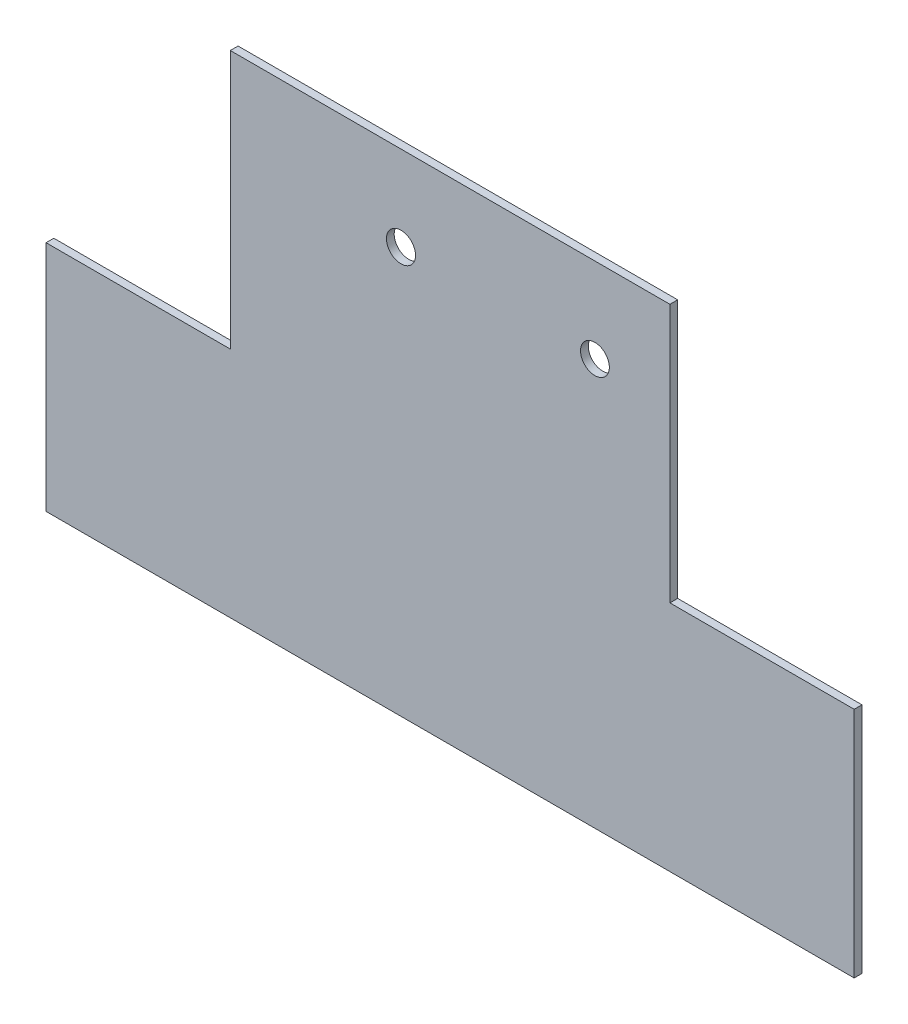
ISO-10303-21;
HEADER;
FILE_DESCRIPTION(('STEP AP214'),'2;1');
FILE_NAME('part.step','',(''),(''),'','','');
FILE_SCHEMA(('AUTOMOTIVE_DESIGN { 1 0 10303 214 1 1 1 1 }'));
ENDSEC;
DATA;
#1=APPLICATION_CONTEXT('core data for automotive mechanical design processes');
#2=APPLICATION_PROTOCOL_DEFINITION('international standard','automotive_design',2000,#1);
#3=PRODUCT_CONTEXT('',#1,'mechanical');
#4=PRODUCT('Part','Part','',(#3));
#5=PRODUCT_RELATED_PRODUCT_CATEGORY('part','',(#4));
#6=PRODUCT_DEFINITION_FORMATION('','',#4);
#7=PRODUCT_DEFINITION_CONTEXT('part definition',#1,'design');
#8=PRODUCT_DEFINITION('design','',#6,#7);
#9=PRODUCT_DEFINITION_SHAPE('','',#8);
#10=(LENGTH_UNIT() NAMED_UNIT(*) SI_UNIT(.MILLI.,.METRE.));
#11=(NAMED_UNIT(*) PLANE_ANGLE_UNIT() SI_UNIT($,.RADIAN.));
#12=(NAMED_UNIT(*) SI_UNIT($,.STERADIAN.) SOLID_ANGLE_UNIT());
#13=UNCERTAINTY_MEASURE_WITH_UNIT(LENGTH_MEASURE(1.E-05),#10,'distance_accuracy_value','');
#14=(GEOMETRIC_REPRESENTATION_CONTEXT(3) GLOBAL_UNCERTAINTY_ASSIGNED_CONTEXT((#13)) GLOBAL_UNIT_ASSIGNED_CONTEXT((#10,
#11,#12)) REPRESENTATION_CONTEXT('',''));
#15=CARTESIAN_POINT('',(0.,0.,0.));
#16=DIRECTION('',(0.,0.,1.));
#17=DIRECTION('',(1.,0.,0.));
#18=AXIS2_PLACEMENT_3D('',#15,#16,#17);
#19=CARTESIAN_POINT('',(0.,0.,-1.2));
#20=DIRECTION('',(-1.,0.,0.));
#21=DIRECTION('',(0.,0.,1.));
#22=AXIS2_PLACEMENT_3D('',#19,#20,#21);
#23=PLANE('',#22);
#24=DIRECTION('',(0.,-1.,0.));
#25=VECTOR('',#24,1.);
#26=CARTESIAN_POINT('',(0.,0.,0.));
#27=LINE('',#26,#25);
#28=CARTESIAN_POINT('',(0.,36.,0.));
#29=VERTEX_POINT('',#28);
#30=CARTESIAN_POINT('',(0.,0.,0.));
#31=VERTEX_POINT('',#30);
#32=EDGE_CURVE('E136',#29,#31,#27,.T.);
#33=ORIENTED_EDGE('',*,*,#32,.F.);
#34=DIRECTION('',(0.,0.,1.));
#35=VECTOR('',#34,1.);
#36=CARTESIAN_POINT('',(0.,36.,-1.2));
#37=LINE('',#36,#35);
#38=CARTESIAN_POINT('',(0.,36.,-1.2));
#39=VERTEX_POINT('',#38);
#40=EDGE_CURVE('E11',#39,#29,#37,.T.);
#41=ORIENTED_EDGE('',*,*,#40,.F.);
#42=DIRECTION('',(0.,-1.,0.));
#43=VECTOR('',#42,1.);
#44=CARTESIAN_POINT('',(0.,0.,-1.2));
#45=LINE('',#44,#43);
#46=CARTESIAN_POINT('',(0.,0.,-1.2));
#47=VERTEX_POINT('',#46);
#48=EDGE_CURVE('E157',#39,#47,#45,.T.);
#49=ORIENTED_EDGE('',*,*,#48,.T.);
#50=DIRECTION('',(0.,0.,1.));
#51=VECTOR('',#50,1.);
#52=CARTESIAN_POINT('',(0.,0.,-1.2));
#53=LINE('',#52,#51);
#54=EDGE_CURVE('E42',#47,#31,#53,.T.);
#55=ORIENTED_EDGE('',*,*,#54,.T.);
#56=EDGE_LOOP('',(#33,#41,#49,#55));
#57=FACE_BOUND('',#56,.T.);
#58=ADVANCED_FACE('F39',(#57),#23,.T.);
#59=CARTESIAN_POINT('',(0.,36.,-1.2));
#60=DIRECTION('',(0.,1.,0.));
#61=DIRECTION('',(0.,0.,1.));
#62=AXIS2_PLACEMENT_3D('',#59,#60,#61);
#63=PLANE('',#62);
#64=DIRECTION('',(-1.,0.,0.));
#65=VECTOR('',#64,1.);
#66=CARTESIAN_POINT('',(0.,36.,0.));
#67=LINE('',#66,#65);
#68=CARTESIAN_POINT('',(28.5,36.,0.));
#69=VERTEX_POINT('',#68);
#70=EDGE_CURVE('E155',#69,#29,#67,.T.);
#71=ORIENTED_EDGE('',*,*,#70,.F.);
#72=DIRECTION('',(0.,0.,1.));
#73=VECTOR('',#72,1.);
#74=CARTESIAN_POINT('',(28.5,36.,-1.2));
#75=LINE('',#74,#73);
#76=CARTESIAN_POINT('',(28.5,36.,-1.2));
#77=VERTEX_POINT('',#76);
#78=EDGE_CURVE('E48',#77,#69,#75,.T.);
#79=ORIENTED_EDGE('',*,*,#78,.F.);
#80=DIRECTION('',(-1.,0.,0.));
#81=VECTOR('',#80,1.);
#82=CARTESIAN_POINT('',(0.,36.,-1.2));
#83=LINE('',#82,#81);
#84=EDGE_CURVE('E126',#77,#39,#83,.T.);
#85=ORIENTED_EDGE('',*,*,#84,.T.);
#86=ORIENTED_EDGE('',*,*,#40,.T.);
#87=EDGE_LOOP('',(#71,#79,#85,#86));
#88=FACE_BOUND('',#87,.T.);
#89=ADVANCED_FACE('F169',(#88),#63,.T.);
#90=CARTESIAN_POINT('',(28.5,36.,-1.2));
#91=DIRECTION('',(-1.,0.,0.));
#92=DIRECTION('',(0.,0.,1.));
#93=AXIS2_PLACEMENT_3D('',#90,#91,#92);
#94=PLANE('',#93);
#95=DIRECTION('',(0.,-1.,0.));
#96=VECTOR('',#95,1.);
#97=CARTESIAN_POINT('',(28.5,36.,0.));
#98=LINE('',#97,#96);
#99=CARTESIAN_POINT('',(28.5,76.,0.));
#100=VERTEX_POINT('',#99);
#101=EDGE_CURVE('E113',#100,#69,#98,.T.);
#102=ORIENTED_EDGE('',*,*,#101,.F.);
#103=DIRECTION('',(0.,0.,1.));
#104=VECTOR('',#103,1.);
#105=CARTESIAN_POINT('',(28.5,76.,-1.2));
#106=LINE('',#105,#104);
#107=CARTESIAN_POINT('',(28.5,76.,-1.2));
#108=VERTEX_POINT('',#107);
#109=EDGE_CURVE('E108',#108,#100,#106,.T.);
#110=ORIENTED_EDGE('',*,*,#109,.F.);
#111=DIRECTION('',(0.,-1.,0.));
#112=VECTOR('',#111,1.);
#113=CARTESIAN_POINT('',(28.5,36.,-1.2));
#114=LINE('',#113,#112);
#115=EDGE_CURVE('E111',#108,#77,#114,.T.);
#116=ORIENTED_EDGE('',*,*,#115,.T.);
#117=ORIENTED_EDGE('',*,*,#78,.T.);
#118=EDGE_LOOP('',(#102,#110,#116,#117));
#119=FACE_BOUND('',#118,.T.);
#120=ADVANCED_FACE('F110',(#119),#94,.T.);
#121=CARTESIAN_POINT('',(28.5,76.,-1.2));
#122=DIRECTION('',(0.,1.,0.));
#123=DIRECTION('',(0.,0.,1.));
#124=AXIS2_PLACEMENT_3D('',#121,#122,#123);
#125=PLANE('',#124);
#126=DIRECTION('',(-1.,0.,0.));
#127=VECTOR('',#126,1.);
#128=CARTESIAN_POINT('',(28.5,76.,0.));
#129=LINE('',#128,#127);
#130=CARTESIAN_POINT('',(96.5,76.,0.));
#131=VERTEX_POINT('',#130);
#132=EDGE_CURVE('E152',#131,#100,#129,.T.);
#133=ORIENTED_EDGE('',*,*,#132,.F.);
#134=DIRECTION('',(0.,0.,1.));
#135=VECTOR('',#134,1.);
#136=CARTESIAN_POINT('',(96.5,76.,-1.2));
#137=LINE('',#136,#135);
#138=CARTESIAN_POINT('',(96.5,76.,-1.2));
#139=VERTEX_POINT('',#138);
#140=EDGE_CURVE('E118',#139,#131,#137,.T.);
#141=ORIENTED_EDGE('',*,*,#140,.F.);
#142=DIRECTION('',(-1.,0.,0.));
#143=VECTOR('',#142,1.);
#144=CARTESIAN_POINT('',(28.5,76.,-1.2));
#145=LINE('',#144,#143);
#146=EDGE_CURVE('E124',#139,#108,#145,.T.);
#147=ORIENTED_EDGE('',*,*,#146,.T.);
#148=ORIENTED_EDGE('',*,*,#109,.T.);
#149=EDGE_LOOP('',(#133,#141,#147,#148));
#150=FACE_BOUND('',#149,.T.);
#151=ADVANCED_FACE('F128',(#150),#125,.T.);
#152=CARTESIAN_POINT('',(96.5,76.,-1.2));
#153=DIRECTION('',(1.,0.,0.));
#154=DIRECTION('',(0.,0.,-1.));
#155=AXIS2_PLACEMENT_3D('',#152,#153,#154);
#156=PLANE('',#155);
#157=DIRECTION('',(0.,1.,0.));
#158=VECTOR('',#157,1.);
#159=CARTESIAN_POINT('',(96.5,76.,0.));
#160=LINE('',#159,#158);
#161=CARTESIAN_POINT('',(96.5,36.,0.));
#162=VERTEX_POINT('',#161);
#163=EDGE_CURVE('E149',#162,#131,#160,.T.);
#164=ORIENTED_EDGE('',*,*,#163,.F.);
#165=DIRECTION('',(0.,0.,1.));
#166=VECTOR('',#165,1.);
#167=CARTESIAN_POINT('',(96.5,36.,-1.2));
#168=LINE('',#167,#166);
#169=CARTESIAN_POINT('',(96.5,36.,-1.2));
#170=VERTEX_POINT('',#169);
#171=EDGE_CURVE('E161',#170,#162,#168,.T.);
#172=ORIENTED_EDGE('',*,*,#171,.F.);
#173=DIRECTION('',(0.,1.,0.));
#174=VECTOR('',#173,1.);
#175=CARTESIAN_POINT('',(96.5,76.,-1.2));
#176=LINE('',#175,#174);
#177=EDGE_CURVE('E129',#170,#139,#176,.T.);
#178=ORIENTED_EDGE('',*,*,#177,.T.);
#179=ORIENTED_EDGE('',*,*,#140,.T.);
#180=EDGE_LOOP('',(#164,#172,#178,#179));
#181=FACE_BOUND('',#180,.T.);
#182=ADVANCED_FACE('F182',(#181),#156,.T.);
#183=CARTESIAN_POINT('',(96.5,36.,-1.2));
#184=DIRECTION('',(0.,1.,0.));
#185=DIRECTION('',(-1.,0.,0.));
#186=AXIS2_PLACEMENT_3D('',#183,#184,#185);
#187=PLANE('',#186);
#188=DIRECTION('',(-1.,0.,0.));
#189=VECTOR('',#188,1.);
#190=CARTESIAN_POINT('',(96.5,36.,0.));
#191=LINE('',#190,#189);
#192=CARTESIAN_POINT('',(125.,36.,0.));
#193=VERTEX_POINT('',#192);
#194=EDGE_CURVE('E146',#193,#162,#191,.T.);
#195=ORIENTED_EDGE('',*,*,#194,.F.);
#196=DIRECTION('',(0.,0.,1.));
#197=VECTOR('',#196,1.);
#198=CARTESIAN_POINT('',(125.,36.,-1.2));
#199=LINE('',#198,#197);
#200=CARTESIAN_POINT('',(125.,36.,-1.2));
#201=VERTEX_POINT('',#200);
#202=EDGE_CURVE('E163',#201,#193,#199,.T.);
#203=ORIENTED_EDGE('',*,*,#202,.F.);
#204=DIRECTION('',(-1.,0.,0.));
#205=VECTOR('',#204,1.);
#206=CARTESIAN_POINT('',(96.5,36.,-1.2));
#207=LINE('',#206,#205);
#208=EDGE_CURVE('E131',#201,#170,#207,.T.);
#209=ORIENTED_EDGE('',*,*,#208,.T.);
#210=ORIENTED_EDGE('',*,*,#171,.T.);
#211=EDGE_LOOP('',(#195,#203,#209,#210));
#212=FACE_BOUND('',#211,.T.);
#213=ADVANCED_FACE('F185',(#212),#187,.T.);
#214=CARTESIAN_POINT('',(125.,0.,-1.2));
#215=DIRECTION('',(1.,0.,0.));
#216=DIRECTION('',(0.,0.,-1.));
#217=AXIS2_PLACEMENT_3D('',#214,#215,#216);
#218=PLANE('',#217);
#219=DIRECTION('',(0.,1.,0.));
#220=VECTOR('',#219,1.);
#221=CARTESIAN_POINT('',(125.,0.,0.));
#222=LINE('',#221,#220);
#223=CARTESIAN_POINT('',(125.,0.,0.));
#224=VERTEX_POINT('',#223);
#225=EDGE_CURVE('E143',#224,#193,#222,.T.);
#226=ORIENTED_EDGE('',*,*,#225,.F.);
#227=DIRECTION('',(0.,0.,1.));
#228=VECTOR('',#227,1.);
#229=CARTESIAN_POINT('',(125.,0.,-1.2));
#230=LINE('',#229,#228);
#231=CARTESIAN_POINT('',(125.,0.,-1.2));
#232=VERTEX_POINT('',#231);
#233=EDGE_CURVE('E164',#232,#224,#230,.T.);
#234=ORIENTED_EDGE('',*,*,#233,.F.);
#235=DIRECTION('',(0.,1.,0.));
#236=VECTOR('',#235,1.);
#237=CARTESIAN_POINT('',(125.,0.,-1.2));
#238=LINE('',#237,#236);
#239=EDGE_CURVE('E231',#232,#201,#238,.T.);
#240=ORIENTED_EDGE('',*,*,#239,.T.);
#241=ORIENTED_EDGE('',*,*,#202,.T.);
#242=EDGE_LOOP('',(#226,#234,#240,#241));
#243=FACE_BOUND('',#242,.T.);
#244=ADVANCED_FACE('F189',(#243),#218,.T.);
#245=CARTESIAN_POINT('',(0.,0.,-1.2));
#246=DIRECTION('',(0.,-1.,0.));
#247=DIRECTION('',(0.,0.,-1.));
#248=AXIS2_PLACEMENT_3D('',#245,#246,#247);
#249=PLANE('',#248);
#250=DIRECTION('',(1.,0.,0.));
#251=VECTOR('',#250,1.);
#252=CARTESIAN_POINT('',(0.,0.,0.));
#253=LINE('',#252,#251);
#254=EDGE_CURVE('E139',#31,#224,#253,.T.);
#255=ORIENTED_EDGE('',*,*,#254,.F.);
#256=ORIENTED_EDGE('',*,*,#54,.F.);
#257=DIRECTION('',(1.,0.,0.));
#258=VECTOR('',#257,1.);
#259=CARTESIAN_POINT('',(0.,0.,-1.2));
#260=LINE('',#259,#258);
#261=EDGE_CURVE('E229',#47,#232,#260,.T.);
#262=ORIENTED_EDGE('',*,*,#261,.T.);
#263=ORIENTED_EDGE('',*,*,#233,.T.);
#264=EDGE_LOOP('',(#255,#256,#262,#263));
#265=FACE_BOUND('',#264,.T.);
#266=ADVANCED_FACE('F166',(#265),#249,.T.);
#267=CARTESIAN_POINT('',(0.,0.,-1.2));
#268=DIRECTION('',(0.,0.,-1.));
#269=DIRECTION('',(-1.,0.,0.));
#270=AXIS2_PLACEMENT_3D('',#267,#268,#269);
#271=PLANE('',#270);
#272=CARTESIAN_POINT('',(84.8999999999992,62.8699999999998,-1.2));
#273=DIRECTION('',(0.,0.,1.));
#274=DIRECTION('',(1.,0.,0.));
#275=AXIS2_PLACEMENT_3D('',#272,#273,#274);
#276=CIRCLE('',#275,2.22734847298146);
#277=CARTESIAN_POINT('',(87.1273484729807,62.8699999999998,-1.2));
#278=VERTEX_POINT('',#277);
#279=EDGE_CURVE('E216',#278,#278,#276,.T.);
#280=ORIENTED_EDGE('',*,*,#279,.T.);
#281=EDGE_LOOP('',(#280));
#282=FACE_BOUND('',#281,.T.);
#283=CARTESIAN_POINT('',(54.8999999999992,62.8699999999998,-1.2));
#284=DIRECTION('',(0.,0.,1.));
#285=DIRECTION('',(1.,0.,0.));
#286=AXIS2_PLACEMENT_3D('',#283,#284,#285);
#287=CIRCLE('',#286,2.25);
#288=CARTESIAN_POINT('',(57.1499999999992,62.8699999999998,-1.2));
#289=VERTEX_POINT('',#288);
#290=EDGE_CURVE('E140',#289,#289,#287,.T.);
#291=ORIENTED_EDGE('',*,*,#290,.T.);
#292=EDGE_LOOP('',(#291));
#293=FACE_BOUND('',#292,.T.);
#294=ORIENTED_EDGE('',*,*,#48,.F.);
#295=ORIENTED_EDGE('',*,*,#84,.F.);
#296=ORIENTED_EDGE('',*,*,#115,.F.);
#297=ORIENTED_EDGE('',*,*,#146,.F.);
#298=ORIENTED_EDGE('',*,*,#177,.F.);
#299=ORIENTED_EDGE('',*,*,#208,.F.);
#300=ORIENTED_EDGE('',*,*,#239,.F.);
#301=ORIENTED_EDGE('',*,*,#261,.F.);
#302=EDGE_LOOP('',(#294,#295,#296,#297,#298,#299,#300,#301));
#303=FACE_BOUND('',#302,.T.);
#304=ADVANCED_FACE('F122',(#282,#293,#303),#271,.T.);
#305=CARTESIAN_POINT('',(0.,0.,0.));
#306=DIRECTION('',(0.,0.,-1.));
#307=DIRECTION('',(-1.,0.,0.));
#308=AXIS2_PLACEMENT_3D('',#305,#306,#307);
#309=PLANE('',#308);
#310=CARTESIAN_POINT('',(84.8999999999992,62.8699999999998,0.));
#311=DIRECTION('',(0.,0.,1.));
#312=DIRECTION('',(1.,0.,0.));
#313=AXIS2_PLACEMENT_3D('',#310,#311,#312);
#314=CIRCLE('',#313,2.22734847298146);
#315=CARTESIAN_POINT('',(87.1273484729807,62.8699999999998,0.));
#316=VERTEX_POINT('',#315);
#317=EDGE_CURVE('E219',#316,#316,#314,.T.);
#318=ORIENTED_EDGE('',*,*,#317,.F.);
#319=EDGE_LOOP('',(#318));
#320=FACE_BOUND('',#319,.T.);
#321=CARTESIAN_POINT('',(54.8999999999992,62.8699999999998,0.));
#322=DIRECTION('',(0.,0.,1.));
#323=DIRECTION('',(1.,0.,0.));
#324=AXIS2_PLACEMENT_3D('',#321,#322,#323);
#325=CIRCLE('',#324,2.25);
#326=CARTESIAN_POINT('',(57.1499999999992,62.8699999999998,0.));
#327=VERTEX_POINT('',#326);
#328=EDGE_CURVE('E221',#327,#327,#325,.T.);
#329=ORIENTED_EDGE('',*,*,#328,.F.);
#330=EDGE_LOOP('',(#329));
#331=FACE_BOUND('',#330,.T.);
#332=ORIENTED_EDGE('',*,*,#32,.T.);
#333=ORIENTED_EDGE('',*,*,#254,.T.);
#334=ORIENTED_EDGE('',*,*,#225,.T.);
#335=ORIENTED_EDGE('',*,*,#194,.T.);
#336=ORIENTED_EDGE('',*,*,#163,.T.);
#337=ORIENTED_EDGE('',*,*,#132,.T.);
#338=ORIENTED_EDGE('',*,*,#101,.T.);
#339=ORIENTED_EDGE('',*,*,#70,.T.);
#340=EDGE_LOOP('',(#332,#333,#334,#335,#336,#337,#338,#339));
#341=FACE_BOUND('',#340,.T.);
#342=ADVANCED_FACE('F168',(#320,#331,#341),#309,.F.);
#343=CARTESIAN_POINT('',(54.8999999999992,62.8699999999998,-1.2));
#344=DIRECTION('',(0.,0.,1.));
#345=DIRECTION('',(1.,0.,0.));
#346=AXIS2_PLACEMENT_3D('',#343,#344,#345);
#347=CYLINDRICAL_SURFACE('',#346,2.25);
#348=ORIENTED_EDGE('',*,*,#290,.F.);
#349=EDGE_LOOP('',(#348));
#350=FACE_BOUND('',#349,.T.);
#351=ORIENTED_EDGE('',*,*,#328,.T.);
#352=EDGE_LOOP('',(#351));
#353=FACE_BOUND('',#352,.T.);
#354=ADVANCED_FACE('F201',(#350,#353),#347,.F.);
#355=CARTESIAN_POINT('',(84.8999999999992,62.8699999999998,-1.2));
#356=DIRECTION('',(0.,0.,1.));
#357=DIRECTION('',(1.,0.,0.));
#358=AXIS2_PLACEMENT_3D('',#355,#356,#357);
#359=CYLINDRICAL_SURFACE('',#358,2.22734847298146);
#360=ORIENTED_EDGE('',*,*,#279,.F.);
#361=EDGE_LOOP('',(#360));
#362=FACE_BOUND('',#361,.T.);
#363=ORIENTED_EDGE('',*,*,#317,.T.);
#364=EDGE_LOOP('',(#363));
#365=FACE_BOUND('',#364,.T.);
#366=ADVANCED_FACE('F208',(#362,#365),#359,.F.);
#367=CLOSED_SHELL('',(#58,#89,#120,#151,#182,#213,#244,#266,#304,#342,#354,#366));
#368=MANIFOLD_SOLID_BREP('B2',#367);
#369=ADVANCED_BREP_SHAPE_REPRESENTATION('',(#18,#368),#14);
#370=SHAPE_DEFINITION_REPRESENTATION(#9,#369);
ENDSEC;
END-ISO-10303-21;
